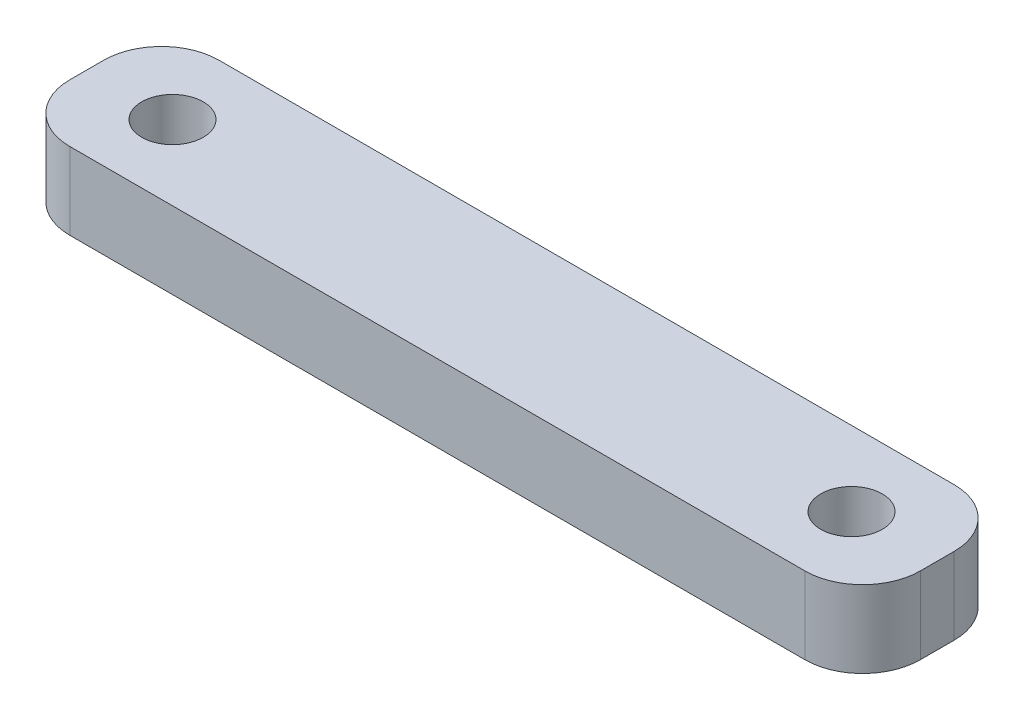
ISO-10303-21;
HEADER;
FILE_DESCRIPTION(('STEP AP214'),'2;1');
FILE_NAME('part.step','',(''),(''),'','','');
FILE_SCHEMA(('AUTOMOTIVE_DESIGN { 1 0 10303 214 1 1 1 1 }'));
ENDSEC;
DATA;
#1=APPLICATION_CONTEXT('core data for automotive mechanical design processes');
#2=APPLICATION_PROTOCOL_DEFINITION('international standard','automotive_design',2000,#1);
#3=PRODUCT_CONTEXT('',#1,'mechanical');
#4=PRODUCT('Part','Part','',(#3));
#5=PRODUCT_RELATED_PRODUCT_CATEGORY('part','',(#4));
#6=PRODUCT_DEFINITION_FORMATION('','',#4);
#7=PRODUCT_DEFINITION_CONTEXT('part definition',#1,'design');
#8=PRODUCT_DEFINITION('design','',#6,#7);
#9=PRODUCT_DEFINITION_SHAPE('','',#8);
#10=(LENGTH_UNIT() NAMED_UNIT(*) SI_UNIT(.MILLI.,.METRE.));
#11=(NAMED_UNIT(*) PLANE_ANGLE_UNIT() SI_UNIT($,.RADIAN.));
#12=(NAMED_UNIT(*) SI_UNIT($,.STERADIAN.) SOLID_ANGLE_UNIT());
#13=UNCERTAINTY_MEASURE_WITH_UNIT(LENGTH_MEASURE(1.E-05),#10,'distance_accuracy_value','');
#14=(GEOMETRIC_REPRESENTATION_CONTEXT(3) GLOBAL_UNCERTAINTY_ASSIGNED_CONTEXT((#13)) GLOBAL_UNIT_ASSIGNED_CONTEXT((#10,
#11,#12)) REPRESENTATION_CONTEXT('',''));
#15=CARTESIAN_POINT('',(0.,0.,0.));
#16=DIRECTION('',(0.,0.,1.));
#17=DIRECTION('',(1.,0.,0.));
#18=AXIS2_PLACEMENT_3D('',#15,#16,#17);
#19=CARTESIAN_POINT('',(0.,4.,0.));
#20=DIRECTION('',(0.,1.,0.));
#21=DIRECTION('',(0.,0.,1.));
#22=AXIS2_PLACEMENT_3D('',#19,#20,#21);
#23=PLANE('',#22);
#24=CARTESIAN_POINT('',(-17.65,4.,0.));
#25=DIRECTION('',(0.,1.,0.));
#26=DIRECTION('',(0.,0.,1.));
#27=AXIS2_PLACEMENT_3D('',#24,#25,#26);
#28=CIRCLE('',#27,1.6);
#29=CARTESIAN_POINT('',(-17.65,4.,1.6));
#30=VERTEX_POINT('',#29);
#31=EDGE_CURVE('E128',#30,#30,#28,.T.);
#32=ORIENTED_EDGE('',*,*,#31,.F.);
#33=EDGE_LOOP('',(#32));
#34=FACE_BOUND('',#33,.T.);
#35=DIRECTION('',(-1.,0.,0.));
#36=VECTOR('',#35,1.);
#37=CARTESIAN_POINT('',(22.1088511383018,4.,-3.88134356355615));
#38=LINE('',#37,#36);
#39=CARTESIAN_POINT('',(19.1088511383018,4.,-3.88134356355615));
#40=VERTEX_POINT('',#39);
#41=CARTESIAN_POINT('',(-19.1088511383018,4.,-3.88134356355615));
#42=VERTEX_POINT('',#41);
#43=EDGE_CURVE('E137',#40,#42,#38,.T.);
#44=ORIENTED_EDGE('',*,*,#43,.T.);
#45=CARTESIAN_POINT('',(-19.1088511383018,4.,-0.881343563556149));
#46=DIRECTION('',(0.,1.,0.));
#47=DIRECTION('',(0.,0.,1.));
#48=AXIS2_PLACEMENT_3D('',#45,#46,#47);
#49=CIRCLE('',#48,3.);
#50=CARTESIAN_POINT('',(-22.1088511383018,4.,-0.881343563556149));
#51=VERTEX_POINT('',#50);
#52=EDGE_CURVE('E156',#42,#51,#49,.T.);
#53=ORIENTED_EDGE('',*,*,#52,.T.);
#54=DIRECTION('',(0.,0.,1.));
#55=VECTOR('',#54,1.);
#56=CARTESIAN_POINT('',(-22.1088511383018,4.,3.88134356355615));
#57=LINE('',#56,#55);
#58=CARTESIAN_POINT('',(-22.1088511383018,4.,0.881343563556152));
#59=VERTEX_POINT('',#58);
#60=EDGE_CURVE('E120',#51,#59,#57,.T.);
#61=ORIENTED_EDGE('',*,*,#60,.T.);
#62=CARTESIAN_POINT('',(-19.1088511383018,4.,0.881343563556152));
#63=DIRECTION('',(0.,1.,0.));
#64=DIRECTION('',(0.,0.,1.));
#65=AXIS2_PLACEMENT_3D('',#62,#63,#64);
#66=CIRCLE('',#65,3.);
#67=CARTESIAN_POINT('',(-19.1088511383018,4.,3.88134356355615));
#68=VERTEX_POINT('',#67);
#69=EDGE_CURVE('E151',#59,#68,#66,.T.);
#70=ORIENTED_EDGE('',*,*,#69,.T.);
#71=DIRECTION('',(1.,0.,0.));
#72=VECTOR('',#71,1.);
#73=CARTESIAN_POINT('',(22.1088511383018,4.,3.88134356355615));
#74=LINE('',#73,#72);
#75=CARTESIAN_POINT('',(19.1088511383018,4.,3.88134356355615));
#76=VERTEX_POINT('',#75);
#77=EDGE_CURVE('E167',#68,#76,#74,.T.);
#78=ORIENTED_EDGE('',*,*,#77,.T.);
#79=CARTESIAN_POINT('',(19.1088511383018,4.,0.881343563556152));
#80=DIRECTION('',(0.,1.,0.));
#81=DIRECTION('',(0.,0.,1.));
#82=AXIS2_PLACEMENT_3D('',#79,#80,#81);
#83=CIRCLE('',#82,3.);
#84=CARTESIAN_POINT('',(22.1088511383018,4.,0.881343563556152));
#85=VERTEX_POINT('',#84);
#86=EDGE_CURVE('E56',#76,#85,#83,.T.);
#87=ORIENTED_EDGE('',*,*,#86,.T.);
#88=DIRECTION('',(0.,0.,-1.));
#89=VECTOR('',#88,1.);
#90=CARTESIAN_POINT('',(22.1088511383018,4.,3.88134356355615));
#91=LINE('',#90,#89);
#92=CARTESIAN_POINT('',(22.1088511383018,4.,-0.881343563556149));
#93=VERTEX_POINT('',#92);
#94=EDGE_CURVE('E175',#85,#93,#91,.T.);
#95=ORIENTED_EDGE('',*,*,#94,.T.);
#96=CARTESIAN_POINT('',(19.1088511383018,4.,-0.881343563556149));
#97=DIRECTION('',(0.,1.,0.));
#98=DIRECTION('',(0.,0.,1.));
#99=AXIS2_PLACEMENT_3D('',#96,#97,#98);
#100=CIRCLE('',#99,3.);
#101=EDGE_CURVE('E154',#93,#40,#100,.T.);
#102=ORIENTED_EDGE('',*,*,#101,.T.);
#103=EDGE_LOOP('',(#44,#53,#61,#70,#78,#87,#95,#102));
#104=FACE_BOUND('',#103,.T.);
#105=CARTESIAN_POINT('',(17.65,4.,0.));
#106=DIRECTION('',(0.,1.,0.));
#107=DIRECTION('',(0.,0.,-1.));
#108=AXIS2_PLACEMENT_3D('',#105,#106,#107);
#109=CIRCLE('',#108,1.6);
#110=CARTESIAN_POINT('',(17.65,4.,-1.59999999999999));
#111=VERTEX_POINT('',#110);
#112=EDGE_CURVE('E182',#111,#111,#109,.T.);
#113=ORIENTED_EDGE('',*,*,#112,.F.);
#114=EDGE_LOOP('',(#113));
#115=FACE_BOUND('',#114,.T.);
#116=ADVANCED_FACE('F34',(#34,#104,#115),#23,.T.);
#117=CARTESIAN_POINT('',(0.,0.,0.));
#118=DIRECTION('',(0.,1.,0.));
#119=DIRECTION('',(0.,0.,1.));
#120=AXIS2_PLACEMENT_3D('',#117,#118,#119);
#121=PLANE('',#120);
#122=DIRECTION('',(0.,0.,1.));
#123=VECTOR('',#122,1.);
#124=CARTESIAN_POINT('',(-22.1088511383018,0.,3.88134356355615));
#125=LINE('',#124,#123);
#126=CARTESIAN_POINT('',(-22.1088511383018,0.,-0.881343563556149));
#127=VERTEX_POINT('',#126);
#128=CARTESIAN_POINT('',(-22.1088511383018,0.,0.881343563556152));
#129=VERTEX_POINT('',#128);
#130=EDGE_CURVE('E117',#127,#129,#125,.T.);
#131=ORIENTED_EDGE('',*,*,#130,.F.);
#132=CARTESIAN_POINT('',(-19.1088511383018,0.,-0.881343563556149));
#133=DIRECTION('',(0.,1.,0.));
#134=DIRECTION('',(0.,0.,1.));
#135=AXIS2_PLACEMENT_3D('',#132,#133,#134);
#136=CIRCLE('',#135,3.);
#137=CARTESIAN_POINT('',(-19.1088511383018,0.,-3.88134356355615));
#138=VERTEX_POINT('',#137);
#139=EDGE_CURVE('E100',#127,#138,#136,.F.);
#140=ORIENTED_EDGE('',*,*,#139,.T.);
#141=DIRECTION('',(-1.,0.,0.));
#142=VECTOR('',#141,1.);
#143=CARTESIAN_POINT('',(22.1088511383018,0.,-3.88134356355615));
#144=LINE('',#143,#142);
#145=CARTESIAN_POINT('',(19.1088511383018,0.,-3.88134356355615));
#146=VERTEX_POINT('',#145);
#147=EDGE_CURVE('E141',#146,#138,#144,.T.);
#148=ORIENTED_EDGE('',*,*,#147,.F.);
#149=CARTESIAN_POINT('',(19.1088511383018,0.,-0.881343563556149));
#150=DIRECTION('',(0.,1.,0.));
#151=DIRECTION('',(0.,0.,1.));
#152=AXIS2_PLACEMENT_3D('',#149,#150,#151);
#153=CIRCLE('',#152,3.);
#154=CARTESIAN_POINT('',(22.1088511383018,0.,-0.881343563556149));
#155=VERTEX_POINT('',#154);
#156=EDGE_CURVE('E111',#146,#155,#153,.F.);
#157=ORIENTED_EDGE('',*,*,#156,.T.);
#158=DIRECTION('',(0.,0.,-1.));
#159=VECTOR('',#158,1.);
#160=CARTESIAN_POINT('',(22.1088511383018,0.,3.88134356355615));
#161=LINE('',#160,#159);
#162=CARTESIAN_POINT('',(22.1088511383018,0.,0.881343563556152));
#163=VERTEX_POINT('',#162);
#164=EDGE_CURVE('E131',#163,#155,#161,.T.);
#165=ORIENTED_EDGE('',*,*,#164,.F.);
#166=CARTESIAN_POINT('',(19.1088511383018,0.,0.881343563556152));
#167=DIRECTION('',(0.,1.,0.));
#168=DIRECTION('',(0.,0.,1.));
#169=AXIS2_PLACEMENT_3D('',#166,#167,#168);
#170=CIRCLE('',#169,3.);
#171=CARTESIAN_POINT('',(19.1088511383018,0.,3.88134356355615));
#172=VERTEX_POINT('',#171);
#173=EDGE_CURVE('E145',#163,#172,#170,.F.);
#174=ORIENTED_EDGE('',*,*,#173,.T.);
#175=DIRECTION('',(1.,0.,0.));
#176=VECTOR('',#175,1.);
#177=CARTESIAN_POINT('',(22.1088511383018,0.,3.88134356355615));
#178=LINE('',#177,#176);
#179=CARTESIAN_POINT('',(-19.1088511383018,0.,3.88134356355615));
#180=VERTEX_POINT('',#179);
#181=EDGE_CURVE('E127',#180,#172,#178,.T.);
#182=ORIENTED_EDGE('',*,*,#181,.F.);
#183=CARTESIAN_POINT('',(-19.1088511383018,0.,0.881343563556152));
#184=DIRECTION('',(0.,1.,0.));
#185=DIRECTION('',(0.,0.,1.));
#186=AXIS2_PLACEMENT_3D('',#183,#184,#185);
#187=CIRCLE('',#186,3.);
#188=EDGE_CURVE('E121',#180,#129,#187,.F.);
#189=ORIENTED_EDGE('',*,*,#188,.T.);
#190=EDGE_LOOP('',(#131,#140,#148,#157,#165,#174,#182,#189));
#191=FACE_BOUND('',#190,.T.);
#192=CARTESIAN_POINT('',(-17.65,0.,0.));
#193=DIRECTION('',(0.,1.,0.));
#194=DIRECTION('',(0.,0.,1.));
#195=AXIS2_PLACEMENT_3D('',#192,#193,#194);
#196=CIRCLE('',#195,1.6);
#197=CARTESIAN_POINT('',(-17.65,0.,1.6));
#198=VERTEX_POINT('',#197);
#199=EDGE_CURVE('E134',#198,#198,#196,.T.);
#200=ORIENTED_EDGE('',*,*,#199,.T.);
#201=EDGE_LOOP('',(#200));
#202=FACE_BOUND('',#201,.T.);
#203=CARTESIAN_POINT('',(17.65,0.,0.));
#204=DIRECTION('',(0.,1.,0.));
#205=DIRECTION('',(0.,0.,-1.));
#206=AXIS2_PLACEMENT_3D('',#203,#204,#205);
#207=CIRCLE('',#206,1.6);
#208=CARTESIAN_POINT('',(17.65,0.,-1.59999999999999));
#209=VERTEX_POINT('',#208);
#210=EDGE_CURVE('E184',#209,#209,#207,.T.);
#211=ORIENTED_EDGE('',*,*,#210,.T.);
#212=EDGE_LOOP('',(#211));
#213=FACE_BOUND('',#212,.T.);
#214=ADVANCED_FACE('F124',(#191,#202,#213),#121,.F.);
#215=CARTESIAN_POINT('',(-22.1088511383018,4.,3.88134356355615));
#216=DIRECTION('',(1.,0.,0.));
#217=DIRECTION('',(0.,0.,-1.));
#218=AXIS2_PLACEMENT_3D('',#215,#216,#217);
#219=PLANE('',#218);
#220=ORIENTED_EDGE('',*,*,#60,.F.);
#221=DIRECTION('',(0.,-1.,0.));
#222=VECTOR('',#221,1.);
#223=CARTESIAN_POINT('',(-22.1088511383018,4.,-0.881343563556149));
#224=LINE('',#223,#222);
#225=EDGE_CURVE('E104',#51,#127,#224,.T.);
#226=ORIENTED_EDGE('',*,*,#225,.T.);
#227=ORIENTED_EDGE('',*,*,#130,.T.);
#228=DIRECTION('',(0.,-1.,0.));
#229=VECTOR('',#228,1.);
#230=CARTESIAN_POINT('',(-22.1088511383018,4.,0.881343563556152));
#231=LINE('',#230,#229);
#232=EDGE_CURVE('E122',#129,#59,#231,.F.);
#233=ORIENTED_EDGE('',*,*,#232,.T.);
#234=EDGE_LOOP('',(#220,#226,#227,#233));
#235=FACE_BOUND('',#234,.T.);
#236=ADVANCED_FACE('F116',(#235),#219,.F.);
#237=CARTESIAN_POINT('',(22.1088511383018,4.,3.88134356355615));
#238=DIRECTION('',(0.,0.,-1.));
#239=DIRECTION('',(-1.,0.,0.));
#240=AXIS2_PLACEMENT_3D('',#237,#238,#239);
#241=PLANE('',#240);
#242=ORIENTED_EDGE('',*,*,#181,.T.);
#243=DIRECTION('',(0.,-1.,0.));
#244=VECTOR('',#243,1.);
#245=CARTESIAN_POINT('',(19.1088511383018,4.,3.88134356355615));
#246=LINE('',#245,#244);
#247=EDGE_CURVE('E11',#172,#76,#246,.F.);
#248=ORIENTED_EDGE('',*,*,#247,.T.);
#249=ORIENTED_EDGE('',*,*,#77,.F.);
#250=DIRECTION('',(0.,-1.,0.));
#251=VECTOR('',#250,1.);
#252=CARTESIAN_POINT('',(-19.1088511383018,4.,3.88134356355615));
#253=LINE('',#252,#251);
#254=EDGE_CURVE('E42',#68,#180,#253,.T.);
#255=ORIENTED_EDGE('',*,*,#254,.T.);
#256=EDGE_LOOP('',(#242,#248,#249,#255));
#257=FACE_BOUND('',#256,.T.);
#258=ADVANCED_FACE('F165',(#257),#241,.F.);
#259=CARTESIAN_POINT('',(22.1088511383018,4.,3.88134356355615));
#260=DIRECTION('',(-1.,0.,0.));
#261=DIRECTION('',(0.,0.,1.));
#262=AXIS2_PLACEMENT_3D('',#259,#260,#261);
#263=PLANE('',#262);
#264=ORIENTED_EDGE('',*,*,#164,.T.);
#265=DIRECTION('',(0.,-1.,0.));
#266=VECTOR('',#265,1.);
#267=CARTESIAN_POINT('',(22.1088511383018,4.,-0.881343563556149));
#268=LINE('',#267,#266);
#269=EDGE_CURVE('E49',#155,#93,#268,.F.);
#270=ORIENTED_EDGE('',*,*,#269,.T.);
#271=ORIENTED_EDGE('',*,*,#94,.F.);
#272=DIRECTION('',(0.,-1.,0.));
#273=VECTOR('',#272,1.);
#274=CARTESIAN_POINT('',(22.1088511383018,4.,0.881343563556152));
#275=LINE('',#274,#273);
#276=EDGE_CURVE('E158',#85,#163,#275,.T.);
#277=ORIENTED_EDGE('',*,*,#276,.T.);
#278=EDGE_LOOP('',(#264,#270,#271,#277));
#279=FACE_BOUND('',#278,.T.);
#280=ADVANCED_FACE('F174',(#279),#263,.F.);
#281=CARTESIAN_POINT('',(22.1088511383018,4.,-3.88134356355615));
#282=DIRECTION('',(0.,0.,1.));
#283=DIRECTION('',(1.,0.,0.));
#284=AXIS2_PLACEMENT_3D('',#281,#282,#283);
#285=PLANE('',#284);
#286=ORIENTED_EDGE('',*,*,#147,.T.);
#287=DIRECTION('',(0.,-1.,0.));
#288=VECTOR('',#287,1.);
#289=CARTESIAN_POINT('',(-19.1088511383018,4.,-3.88134356355615));
#290=LINE('',#289,#288);
#291=EDGE_CURVE('E105',#138,#42,#290,.F.);
#292=ORIENTED_EDGE('',*,*,#291,.T.);
#293=ORIENTED_EDGE('',*,*,#43,.F.);
#294=DIRECTION('',(0.,-1.,0.));
#295=VECTOR('',#294,1.);
#296=CARTESIAN_POINT('',(19.1088511383018,4.,-3.88134356355615));
#297=LINE('',#296,#295);
#298=EDGE_CURVE('E110',#40,#146,#297,.T.);
#299=ORIENTED_EDGE('',*,*,#298,.T.);
#300=EDGE_LOOP('',(#286,#292,#293,#299));
#301=FACE_BOUND('',#300,.T.);
#302=ADVANCED_FACE('F205',(#301),#285,.F.);
#303=CARTESIAN_POINT('',(-17.65,4.,0.));
#304=DIRECTION('',(0.,-1.,0.));
#305=DIRECTION('',(0.,0.,-1.));
#306=AXIS2_PLACEMENT_3D('',#303,#304,#305);
#307=CYLINDRICAL_SURFACE('',#306,1.6);
#308=ORIENTED_EDGE('',*,*,#31,.T.);
#309=EDGE_LOOP('',(#308));
#310=FACE_BOUND('',#309,.T.);
#311=ORIENTED_EDGE('',*,*,#199,.F.);
#312=EDGE_LOOP('',(#311));
#313=FACE_BOUND('',#312,.T.);
#314=ADVANCED_FACE('F202',(#310,#313),#307,.F.);
#315=CARTESIAN_POINT('',(17.65,4.,0.));
#316=DIRECTION('',(0.,-1.,0.));
#317=DIRECTION('',(0.,0.,-1.));
#318=AXIS2_PLACEMENT_3D('',#315,#316,#317);
#319=CYLINDRICAL_SURFACE('',#318,1.6);
#320=ORIENTED_EDGE('',*,*,#112,.T.);
#321=EDGE_LOOP('',(#320));
#322=FACE_BOUND('',#321,.T.);
#323=ORIENTED_EDGE('',*,*,#210,.F.);
#324=EDGE_LOOP('',(#323));
#325=FACE_BOUND('',#324,.T.);
#326=ADVANCED_FACE('F190',(#322,#325),#319,.F.);
#327=CARTESIAN_POINT('',(-19.1088511383018,4.,-0.881343563556149));
#328=DIRECTION('',(0.,-1.,0.));
#329=DIRECTION('',(0.,0.,-1.));
#330=AXIS2_PLACEMENT_3D('',#327,#328,#329);
#331=CYLINDRICAL_SURFACE('',#330,3.);
#332=ORIENTED_EDGE('',*,*,#52,.F.);
#333=ORIENTED_EDGE('',*,*,#291,.F.);
#334=ORIENTED_EDGE('',*,*,#139,.F.);
#335=ORIENTED_EDGE('',*,*,#225,.F.);
#336=EDGE_LOOP('',(#332,#333,#334,#335));
#337=FACE_BOUND('',#336,.T.);
#338=ADVANCED_FACE('F103',(#337),#331,.T.);
#339=CARTESIAN_POINT('',(19.1088511383018,4.,-0.881343563556149));
#340=DIRECTION('',(0.,-1.,0.));
#341=DIRECTION('',(0.,0.,-1.));
#342=AXIS2_PLACEMENT_3D('',#339,#340,#341);
#343=CYLINDRICAL_SURFACE('',#342,3.);
#344=ORIENTED_EDGE('',*,*,#101,.F.);
#345=ORIENTED_EDGE('',*,*,#269,.F.);
#346=ORIENTED_EDGE('',*,*,#156,.F.);
#347=ORIENTED_EDGE('',*,*,#298,.F.);
#348=EDGE_LOOP('',(#344,#345,#346,#347));
#349=FACE_BOUND('',#348,.T.);
#350=ADVANCED_FACE('F217',(#349),#343,.T.);
#351=CARTESIAN_POINT('',(19.1088511383018,4.,0.881343563556152));
#352=DIRECTION('',(0.,-1.,0.));
#353=DIRECTION('',(0.,0.,-1.));
#354=AXIS2_PLACEMENT_3D('',#351,#352,#353);
#355=CYLINDRICAL_SURFACE('',#354,3.);
#356=ORIENTED_EDGE('',*,*,#86,.F.);
#357=ORIENTED_EDGE('',*,*,#247,.F.);
#358=ORIENTED_EDGE('',*,*,#173,.F.);
#359=ORIENTED_EDGE('',*,*,#276,.F.);
#360=EDGE_LOOP('',(#356,#357,#358,#359));
#361=FACE_BOUND('',#360,.T.);
#362=ADVANCED_FACE('F173',(#361),#355,.T.);
#363=CARTESIAN_POINT('',(-19.1088511383018,4.,0.881343563556152));
#364=DIRECTION('',(0.,-1.,0.));
#365=DIRECTION('',(0.,0.,-1.));
#366=AXIS2_PLACEMENT_3D('',#363,#364,#365);
#367=CYLINDRICAL_SURFACE('',#366,3.);
#368=ORIENTED_EDGE('',*,*,#69,.F.);
#369=ORIENTED_EDGE('',*,*,#232,.F.);
#370=ORIENTED_EDGE('',*,*,#188,.F.);
#371=ORIENTED_EDGE('',*,*,#254,.F.);
#372=EDGE_LOOP('',(#368,#369,#370,#371));
#373=FACE_BOUND('',#372,.T.);
#374=ADVANCED_FACE('F36',(#373),#367,.T.);
#375=CLOSED_SHELL('',(#116,#214,#236,#258,#280,#302,#314,#326,#338,#350,#362,#374));
#376=MANIFOLD_SOLID_BREP('B2',#375);
#377=ADVANCED_BREP_SHAPE_REPRESENTATION('',(#18,#376),#14);
#378=SHAPE_DEFINITION_REPRESENTATION(#9,#377);
ENDSEC;
END-ISO-10303-21;
